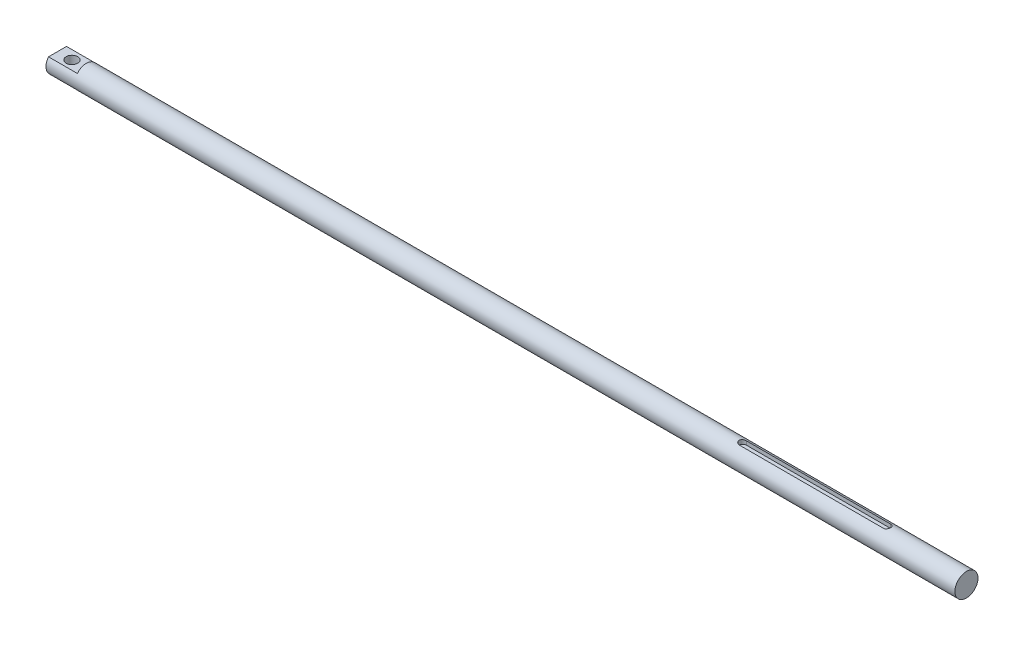
ISO-10303-21;
HEADER;
FILE_DESCRIPTION(('STEP AP214'),'2;1');
FILE_NAME('part.step','',(''),(''),'','','');
FILE_SCHEMA(('AUTOMOTIVE_DESIGN { 1 0 10303 214 1 1 1 1 }'));
ENDSEC;
DATA;
#1=APPLICATION_CONTEXT('core data for automotive mechanical design processes');
#2=APPLICATION_PROTOCOL_DEFINITION('international standard','automotive_design',2000,#1);
#3=PRODUCT_CONTEXT('',#1,'mechanical');
#4=PRODUCT('Part','Part','',(#3));
#5=PRODUCT_RELATED_PRODUCT_CATEGORY('part','',(#4));
#6=PRODUCT_DEFINITION_FORMATION('','',#4);
#7=PRODUCT_DEFINITION_CONTEXT('part definition',#1,'design');
#8=PRODUCT_DEFINITION('design','',#6,#7);
#9=PRODUCT_DEFINITION_SHAPE('','',#8);
#10=(LENGTH_UNIT() NAMED_UNIT(*) SI_UNIT(.MILLI.,.METRE.));
#11=(NAMED_UNIT(*) PLANE_ANGLE_UNIT() SI_UNIT($,.RADIAN.));
#12=(NAMED_UNIT(*) SI_UNIT($,.STERADIAN.) SOLID_ANGLE_UNIT());
#13=UNCERTAINTY_MEASURE_WITH_UNIT(LENGTH_MEASURE(1.E-05),#10,'distance_accuracy_value','');
#14=(GEOMETRIC_REPRESENTATION_CONTEXT(3) GLOBAL_UNCERTAINTY_ASSIGNED_CONTEXT((#13)) GLOBAL_UNIT_ASSIGNED_CONTEXT((#10,
#11,#12)) REPRESENTATION_CONTEXT('',''));
#15=CARTESIAN_POINT('',(0.,0.,0.));
#16=DIRECTION('',(0.,0.,1.));
#17=DIRECTION('',(1.,0.,0.));
#18=AXIS2_PLACEMENT_3D('',#15,#16,#17);
#19=CARTESIAN_POINT('',(630.,0.,0.));
#20=DIRECTION('',(-1.,0.,0.));
#21=DIRECTION('',(0.,0.,1.));
#22=AXIS2_PLACEMENT_3D('',#19,#20,#21);
#23=CYLINDRICAL_SURFACE('',#22,8.);
#24=CARTESIAN_POINT('',(630.,0.,0.));
#25=DIRECTION('',(1.,0.,0.));
#26=DIRECTION('',(0.,0.,-1.));
#27=AXIS2_PLACEMENT_3D('',#24,#25,#26);
#28=CIRCLE('',#27,8.);
#29=CARTESIAN_POINT('',(630.,0.,-8.));
#30=VERTEX_POINT('',#29);
#31=EDGE_CURVE('E158',#30,#30,#28,.T.);
#32=ORIENTED_EDGE('',*,*,#31,.F.);
#33=EDGE_LOOP('',(#32));
#34=FACE_BOUND('',#33,.T.);
#35=DIRECTION('',(-1.,0.,0.));
#36=VECTOR('',#35,1.);
#37=CARTESIAN_POINT('',(630.,5.,-6.2449979983984));
#38=LINE('',#37,#36);
#39=CARTESIAN_POINT('',(20.,5.,-6.2449979983984));
#40=VERTEX_POINT('',#39);
#41=CARTESIAN_POINT('',(0.,5.,-6.2449979983984));
#42=VERTEX_POINT('',#41);
#43=EDGE_CURVE('E155',#40,#42,#38,.T.);
#44=ORIENTED_EDGE('',*,*,#43,.F.);
#45=CARTESIAN_POINT('',(20.,0.,0.));
#46=DIRECTION('',(-1.,0.,0.));
#47=DIRECTION('',(0.,0.,1.));
#48=AXIS2_PLACEMENT_3D('',#45,#46,#47);
#49=CIRCLE('',#48,8.);
#50=CARTESIAN_POINT('',(20.,5.,6.2449979983984));
#51=VERTEX_POINT('',#50);
#52=EDGE_CURVE('E170',#51,#40,#49,.T.);
#53=ORIENTED_EDGE('',*,*,#52,.F.);
#54=DIRECTION('',(-1.,0.,0.));
#55=VECTOR('',#54,1.);
#56=CARTESIAN_POINT('',(630.,5.,6.2449979983984));
#57=LINE('',#56,#55);
#58=CARTESIAN_POINT('',(0.,5.,6.2449979983984));
#59=VERTEX_POINT('',#58);
#60=EDGE_CURVE('E153',#59,#51,#57,.F.);
#61=ORIENTED_EDGE('',*,*,#60,.F.);
#62=CARTESIAN_POINT('',(0.,0.,0.));
#63=DIRECTION('',(1.,0.,0.));
#64=DIRECTION('',(0.,0.,-1.));
#65=AXIS2_PLACEMENT_3D('',#62,#63,#64);
#66=CIRCLE('',#65,8.);
#67=CARTESIAN_POINT('',(0.,-5.,6.2449979983984));
#68=VERTEX_POINT('',#67);
#69=EDGE_CURVE('E162',#59,#68,#66,.T.);
#70=ORIENTED_EDGE('',*,*,#69,.T.);
#71=DIRECTION('',(-1.,0.,0.));
#72=VECTOR('',#71,1.);
#73=CARTESIAN_POINT('',(630.,-5.,6.2449979983984));
#74=LINE('',#73,#72);
#75=CARTESIAN_POINT('',(20.,-5.,6.2449979983984));
#76=VERTEX_POINT('',#75);
#77=EDGE_CURVE('E63',#76,#68,#74,.T.);
#78=ORIENTED_EDGE('',*,*,#77,.F.);
#79=CARTESIAN_POINT('',(20.,-5.,-6.2449979983984));
#80=VERTEX_POINT('',#79);
#81=EDGE_CURVE('E161',#80,#76,#49,.T.);
#82=ORIENTED_EDGE('',*,*,#81,.F.);
#83=DIRECTION('',(-1.,0.,0.));
#84=VECTOR('',#83,1.);
#85=CARTESIAN_POINT('',(630.,-5.,-6.2449979983984));
#86=LINE('',#85,#84);
#87=CARTESIAN_POINT('',(0.,-5.,-6.2449979983984));
#88=VERTEX_POINT('',#87);
#89=EDGE_CURVE('E149',#88,#80,#86,.F.);
#90=ORIENTED_EDGE('',*,*,#89,.F.);
#91=EDGE_CURVE('E157',#88,#42,#66,.T.);
#92=ORIENTED_EDGE('',*,*,#91,.T.);
#93=EDGE_LOOP('',(#44,#53,#61,#70,#78,#82,#90,#92));
#94=FACE_BOUND('',#93,.T.);
#95=CARTESIAN_POINT('',(475.000000000023,7.59934207678533,-2.5));
#96=CARTESIAN_POINT('',(474.931533959565,7.59933203220902,-2.50000871986673));
#97=CARTESIAN_POINT('',(474.863073619994,7.60026710840711,-2.49718761570795));
#98=CARTESIAN_POINT('',(474.726678509763,7.60395280971215,-2.48595363160388));
#99=CARTESIAN_POINT('',(474.658743616427,7.60670299725365,-2.47754209932906));
#100=CARTESIAN_POINT('',(474.524061009507,7.61393458112603,-2.45522504987252));
#101=CARTESIAN_POINT('',(474.457310599726,7.61841131277875,-2.4413343337542));
#102=CARTESIAN_POINT('',(474.325298022129,7.62895048428672,-2.4081974202195));
#103=CARTESIAN_POINT('',(474.260035898613,7.635012971277,-2.38895106361079));
#104=CARTESIAN_POINT('',(474.067212223615,7.65531370854487,-2.32342181812934));
#105=CARTESIAN_POINT('',(473.942431941948,7.67167572075378,-2.26931834784612));
#106=CARTESIAN_POINT('',(473.703712430238,7.70820192004961,-2.14195853376514));
#107=CARTESIAN_POINT('',(473.589778874535,7.72836808096501,-2.06869223944293));
#108=CARTESIAN_POINT('',(473.372050023845,7.77100200099821,-1.90239488451717));
#109=CARTESIAN_POINT('',(473.268677735629,7.79352168290041,-1.80882220631417));
#110=CARTESIAN_POINT('',(473.07880918272,7.83788426191508,-1.60572727958363));
#111=CARTESIAN_POINT('',(472.992315821626,7.85972704204082,-1.49620229250915));
#112=CARTESIAN_POINT('',(472.836776735929,7.900871470787,-1.26124953773951));
#113=CARTESIAN_POINT('',(472.768169952645,7.92010445950109,-1.13551807882696));
#114=CARTESIAN_POINT('',(472.653245915031,7.95325160259623,-0.873602960358824));
#115=CARTESIAN_POINT('',(472.606922529722,7.96716721976384,-0.737422187762075));
#116=CARTESIAN_POINT('',(472.539298114015,7.98774341182849,-0.46293009903665));
#117=CARTESIAN_POINT('',(472.517268955256,7.99461464054437,-0.324814247533371));
#118=CARTESIAN_POINT('',(472.496551274496,8.00107192504097,-0.0466844774853401));
#119=CARTESIAN_POINT('',(472.497857920094,8.00065948913008,0.0933290420878242));
#120=CARTESIAN_POINT('',(472.523296654594,7.99274230032624,0.366149731426198));
#121=CARTESIAN_POINT('',(472.546639028144,7.9854829352957,0.499038795957649));
#122=CARTESIAN_POINT('',(472.614190495554,7.96498949974601,0.758907586764614));
#123=CARTESIAN_POINT('',(472.65840071126,7.95175510801387,0.88588699493651));
#124=CARTESIAN_POINT('',(472.766940633049,7.92046911121014,1.13215685544432));
#125=CARTESIAN_POINT('',(472.831510175278,7.90236047968315,1.25133405943092));
#126=CARTESIAN_POINT('',(472.978743196462,7.86323423852227,1.47740616190408));
#127=CARTESIAN_POINT('',(473.061411060735,7.84221592431151,1.58429807401017));
#128=CARTESIAN_POINT('',(473.246538136379,7.79847545377197,1.78746586605745));
#129=CARTESIAN_POINT('',(473.349677407713,7.77571879038048,1.8831154358427));
#130=CARTESIAN_POINT('',(473.570770310085,7.73181622612536,2.05596538847766));
#131=CARTESIAN_POINT('',(473.688728388829,7.710670811935,2.1331602120539));
#132=CARTESIAN_POINT('',(473.937902943163,7.67220528705139,2.26764925996532));
#133=CARTESIAN_POINT('',(474.069258301443,7.65493278862761,2.32470027292371));
#134=CARTESIAN_POINT('',(474.340311873023,7.62673815128993,2.41560912229087));
#135=CARTESIAN_POINT('',(474.479996830664,7.615806204588,2.44950279382289));
#136=CARTESIAN_POINT('',(474.684175100982,7.6056422512493,2.48078343132755));
#137=CARTESIAN_POINT('',(474.747144936914,7.60328541577532,2.4879880725876));
#138=CARTESIAN_POINT('',(474.873398993315,7.6001348213116,2.49759244704614));
#139=CARTESIAN_POINT('',(474.936682642765,7.59933885501934,2.49999896558874));
#140=CARTESIAN_POINT('',(474.999999999966,7.59934207678533,2.5));
#141=B_SPLINE_CURVE_WITH_KNOTS('',3,(#95,#96,#97,#98,#99,#100,#101,#102,#103,#104,#105,#106,
#107,#108,#109,#110,#111,#112,#113,#114,#115,#116,#117,#118,#119,#120,#121,#122,#123,#124,#125,
#126,#127,#128,#129,#130,#131,#132,#133,#134,#135,#136,#137,#138,#139,#140),.UNSPECIFIED.,.F.,
.F.,(4,2,2,2,2,2,2,2,2,2,2,2,2,2,2,2,2,2,2,2,2,2,4),(0.,0.205323959878836,0.410598440770946,
0.615322164613197,0.82005197436187,1.22896577749132,1.63809233699115,2.05988351400763,
2.48174718582016,2.91315381297093,3.34444167638657,3.7624189439222,4.18030965733185,
4.58377069824248,4.98725343150216,5.39567896994507,5.80420358180014,6.2297165423659,
6.65535752260475,7.08597472101229,7.51592403685244,7.70602799871622,7.8958629307134),.UNSPECIFIED.);
#142=CARTESIAN_POINT('',(475.000000000023,7.59934207678533,-2.5));
#143=VERTEX_POINT('',#142);
#144=CARTESIAN_POINT('',(474.999999999966,7.59934207678533,2.5));
#145=VERTEX_POINT('',#144);
#146=EDGE_CURVE('E171',#143,#145,#141,.T.);
#147=ORIENTED_EDGE('',*,*,#146,.F.);
#148=DIRECTION('',(-1.,0.,0.));
#149=VECTOR('',#148,1.);
#150=CARTESIAN_POINT('',(630.,7.59934207678079,-2.5000000000138));
#151=LINE('',#150,#149);
#152=CARTESIAN_POINT('',(575.000000000045,7.59934207678079,-2.50000000001379));
#153=VERTEX_POINT('',#152);
#154=EDGE_CURVE('E12',#143,#153,#151,.F.);
#155=ORIENTED_EDGE('',*,*,#154,.T.);
#156=CARTESIAN_POINT('',(575.000000000045,7.59934207678534,2.49999999999998));
#157=CARTESIAN_POINT('',(575.068466040503,7.59933203220964,2.50000871986485));
#158=CARTESIAN_POINT('',(575.136926380074,7.60026710840835,2.49718761570418));
#159=CARTESIAN_POINT('',(575.273321490305,7.60395280971462,2.48595363159632));
#160=CARTESIAN_POINT('',(575.341256383642,7.60670299725674,2.4775420993196));
#161=CARTESIAN_POINT('',(575.475938990561,7.61393458113031,2.45522504985927));
#162=CARTESIAN_POINT('',(575.542689400342,7.61841131278361,2.44133433373907));
#163=CARTESIAN_POINT('',(575.674701977938,7.62895048429269,2.4081974202006));
#164=CARTESIAN_POINT('',(575.739964101454,7.63501297128352,2.38895106358999));
#165=CARTESIAN_POINT('',(575.932787776451,7.6553137085529,2.32342181810293));
#166=CARTESIAN_POINT('',(576.057568058117,7.6716757207627,2.26931834781609));
#167=CARTESIAN_POINT('',(576.296287569823,7.70820192005996,2.141958533728));
#168=CARTESIAN_POINT('',(576.410221125524,7.72836808097592,2.0686922394023));
#169=CARTESIAN_POINT('',(576.62794997621,7.77100200100986,1.90239488446972));
#170=CARTESIAN_POINT('',(576.731322264424,7.79352168291224,1.80882220626337));
#171=CARTESIAN_POINT('',(576.921190817328,7.83788426192685,1.60572727952637));
#172=CARTESIAN_POINT('',(577.007684178419,7.85972704205235,1.49620229244878));
#173=CARTESIAN_POINT('',(577.16322326411,7.90087147079751,1.26124953767388));
#174=CARTESIAN_POINT('',(577.23183004739,7.92010445951082,1.13551807875924));
#175=CARTESIAN_POINT('',(577.346754084996,7.95325160260409,0.873602960287575));
#176=CARTESIAN_POINT('',(577.3930774703,7.96716721977058,0.737422187689386));
#177=CARTESIAN_POINT('',(577.460701885999,7.9877434118328,0.462930098962372));
#178=CARTESIAN_POINT('',(577.482731044753,7.99461464054739,0.324814247458944));
#179=CARTESIAN_POINT('',(577.503448725505,8.0010719250414,0.0466844774113888));
#180=CARTESIAN_POINT('',(577.502142079903,8.00065948912921,-0.0933290421611512));
#181=CARTESIAN_POINT('',(577.476703345395,7.99274230032294,-0.366149731497964));
#182=CARTESIAN_POINT('',(577.453360971842,7.98548293529125,-0.499038796028497));
#183=CARTESIAN_POINT('',(577.385809504424,7.96498949973948,-0.758907586833018));
#184=CARTESIAN_POINT('',(577.341599288714,7.9517551080064,-0.885886995003387));
#185=CARTESIAN_POINT('',(577.233059366919,7.920469111201,-1.13215685550818));
#186=CARTESIAN_POINT('',(577.168489824686,7.90236047967326,-1.25133405949323));
#187=CARTESIAN_POINT('',(577.021256803495,7.86323423851123,-1.47740616196273));
#188=CARTESIAN_POINT('',(576.938588939218,7.84221592430006,-1.5842980740667));
#189=CARTESIAN_POINT('',(576.753461863569,7.79847545376009,-1.78746586610914));
#190=CARTESIAN_POINT('',(576.650322592231,7.77571879036859,-1.88311543589166));
#191=CARTESIAN_POINT('',(576.429229689854,7.7318162261139,-2.05596538852062));
#192=CARTESIAN_POINT('',(576.311271611107,7.71067081192399,-2.13316021209358));
#193=CARTESIAN_POINT('',(576.062097056768,7.67220528704181,-2.26764925999761));
#194=CARTESIAN_POINT('',(575.930741698487,7.65493278861901,-2.32470027295196));
#195=CARTESIAN_POINT('',(575.659688126904,7.62673815128358,-2.41560912231083));
#196=CARTESIAN_POINT('',(575.520003169262,7.61580620458293,-2.44950279383862));
#197=CARTESIAN_POINT('',(575.315824898958,7.60564225124689,-2.48078343133491));
#198=CARTESIAN_POINT('',(575.25285506304,7.60328541577389,-2.48798807259196));
#199=CARTESIAN_POINT('',(575.126601006668,7.60013482131143,-2.49759244704668));
#200=CARTESIAN_POINT('',(575.063317357232,7.59933885501944,-2.49999896558846));
#201=CARTESIAN_POINT('',(575.000000000045,7.59934207678533,-2.50000000000002));
#202=B_SPLINE_CURVE_WITH_KNOTS('',3,(#156,#157,#158,#159,#160,#161,#162,#163,#164,#165,#166,
#167,#168,#169,#170,#171,#172,#173,#174,#175,#176,#177,#178,#179,#180,#181,#182,#183,#184,#185,
#186,#187,#188,#189,#190,#191,#192,#193,#194,#195,#196,#197,#198,#199,#200,#201),.UNSPECIFIED.,
.F.,.F.,(4,2,2,2,2,2,2,2,2,2,2,2,2,2,2,2,2,2,2,2,2,2,4),(0.,0.205323959879425,0.410598440772143,
0.615322164615003,0.820051974364466,1.22896577749508,1.63809233699612,2.05988351401434,
2.48174718582851,2.91315381297902,3.34444167639445,3.76241894392834,4.18030965733627,
4.58377069824635,4.98725343150552,5.39567896994971,5.80420358180613,6.2297165423731,
6.65535752261331,7.08597472102025,7.51592403685968,7.7060279986801,7.89586293063386),.UNSPECIFIED.);
#203=CARTESIAN_POINT('',(575.000000000045,7.59934207679137,2.49999999998166));
#204=VERTEX_POINT('',#203);
#205=EDGE_CURVE('E113',#204,#153,#202,.T.);
#206=ORIENTED_EDGE('',*,*,#205,.F.);
#207=DIRECTION('',(-1.,0.,0.));
#208=VECTOR('',#207,1.);
#209=CARTESIAN_POINT('',(630.,7.59934207679137,2.49999999998165));
#210=LINE('',#209,#208);
#211=EDGE_CURVE('E48',#204,#145,#210,.T.);
#212=ORIENTED_EDGE('',*,*,#211,.T.);
#213=EDGE_LOOP('',(#147,#155,#206,#212));
#214=FACE_BOUND('',#213,.T.);
#215=ADVANCED_FACE('F40',(#34,#94,#214),#23,.T.);
#216=CARTESIAN_POINT('',(0.,0.,0.));
#217=DIRECTION('',(1.,0.,0.));
#218=DIRECTION('',(0.,0.,-1.));
#219=AXIS2_PLACEMENT_3D('',#216,#217,#218);
#220=PLANE('',#219);
#221=DIRECTION('',(0.,0.,-1.));
#222=VECTOR('',#221,1.);
#223=CARTESIAN_POINT('',(0.,5.,-10.));
#224=LINE('',#223,#222);
#225=EDGE_CURVE('E142',#59,#42,#224,.T.);
#226=ORIENTED_EDGE('',*,*,#225,.T.);
#227=ORIENTED_EDGE('',*,*,#91,.F.);
#228=DIRECTION('',(0.,0.,1.));
#229=VECTOR('',#228,1.);
#230=CARTESIAN_POINT('',(0.,-5.,-10.));
#231=LINE('',#230,#229);
#232=EDGE_CURVE('E117',#88,#68,#231,.T.);
#233=ORIENTED_EDGE('',*,*,#232,.T.);
#234=ORIENTED_EDGE('',*,*,#69,.F.);
#235=EDGE_LOOP('',(#226,#227,#233,#234));
#236=FACE_BOUND('',#235,.T.);
#237=ADVANCED_FACE('F212',(#236),#220,.F.);
#238=CARTESIAN_POINT('',(630.,0.,0.));
#239=DIRECTION('',(1.,0.,0.));
#240=DIRECTION('',(0.,0.,-1.));
#241=AXIS2_PLACEMENT_3D('',#238,#239,#240);
#242=PLANE('',#241);
#243=ORIENTED_EDGE('',*,*,#31,.T.);
#244=EDGE_LOOP('',(#243));
#245=FACE_BOUND('',#244,.T.);
#246=ADVANCED_FACE('F203',(#245),#242,.T.);
#247=CARTESIAN_POINT('',(20.,-5.,-10.));
#248=DIRECTION('',(0.,-1.,0.));
#249=DIRECTION('',(0.,0.,-1.));
#250=AXIS2_PLACEMENT_3D('',#247,#248,#249);
#251=PLANE('',#250);
#252=CARTESIAN_POINT('',(10.,-5.,0.));
#253=DIRECTION('',(0.,-1.,0.));
#254=DIRECTION('',(0.,0.,-1.));
#255=AXIS2_PLACEMENT_3D('',#252,#253,#254);
#256=CIRCLE('',#255,4.);
#257=CARTESIAN_POINT('',(10.,-5.,-4.));
#258=VERTEX_POINT('',#257);
#259=EDGE_CURVE('E145',#258,#258,#256,.F.);
#260=ORIENTED_EDGE('',*,*,#259,.T.);
#261=EDGE_LOOP('',(#260));
#262=FACE_BOUND('',#261,.T.);
#263=ORIENTED_EDGE('',*,*,#77,.T.);
#264=ORIENTED_EDGE('',*,*,#232,.F.);
#265=ORIENTED_EDGE('',*,*,#89,.T.);
#266=DIRECTION('',(0.,0.,1.));
#267=VECTOR('',#266,1.);
#268=CARTESIAN_POINT('',(20.,-5.,-10.));
#269=LINE('',#268,#267);
#270=EDGE_CURVE('E139',#80,#76,#269,.T.);
#271=ORIENTED_EDGE('',*,*,#270,.T.);
#272=EDGE_LOOP('',(#263,#264,#265,#271));
#273=FACE_BOUND('',#272,.T.);
#274=ADVANCED_FACE('F199',(#262,#273),#251,.T.);
#275=CARTESIAN_POINT('',(20.,0.,0.));
#276=DIRECTION('',(-1.,0.,0.));
#277=DIRECTION('',(0.,0.,1.));
#278=AXIS2_PLACEMENT_3D('',#275,#276,#277);
#279=PLANE('',#278);
#280=ORIENTED_EDGE('',*,*,#81,.T.);
#281=ORIENTED_EDGE('',*,*,#270,.F.);
#282=EDGE_LOOP('',(#280,#281));
#283=FACE_BOUND('',#282,.T.);
#284=ADVANCED_FACE('F202',(#283),#279,.T.);
#285=ORIENTED_EDGE('',*,*,#52,.T.);
#286=DIRECTION('',(0.,0.,-1.));
#287=VECTOR('',#286,1.);
#288=CARTESIAN_POINT('',(20.,5.,-10.));
#289=LINE('',#288,#287);
#290=EDGE_CURVE('E141',#51,#40,#289,.T.);
#291=ORIENTED_EDGE('',*,*,#290,.F.);
#292=EDGE_LOOP('',(#285,#291));
#293=FACE_BOUND('',#292,.T.);
#294=ADVANCED_FACE('F197',(#293),#279,.T.);
#295=CARTESIAN_POINT('',(20.,5.,-10.));
#296=DIRECTION('',(0.,1.,0.));
#297=DIRECTION('',(0.,0.,1.));
#298=AXIS2_PLACEMENT_3D('',#295,#296,#297);
#299=PLANE('',#298);
#300=CARTESIAN_POINT('',(10.,5.,0.));
#301=DIRECTION('',(0.,1.,0.));
#302=DIRECTION('',(0.,0.,1.));
#303=AXIS2_PLACEMENT_3D('',#300,#301,#302);
#304=CIRCLE('',#303,4.);
#305=CARTESIAN_POINT('',(10.,5.,4.));
#306=VERTEX_POINT('',#305);
#307=EDGE_CURVE('E152',#306,#306,#304,.F.);
#308=ORIENTED_EDGE('',*,*,#307,.T.);
#309=EDGE_LOOP('',(#308));
#310=FACE_BOUND('',#309,.T.);
#311=ORIENTED_EDGE('',*,*,#43,.T.);
#312=ORIENTED_EDGE('',*,*,#225,.F.);
#313=ORIENTED_EDGE('',*,*,#60,.T.);
#314=ORIENTED_EDGE('',*,*,#290,.T.);
#315=EDGE_LOOP('',(#311,#312,#313,#314));
#316=FACE_BOUND('',#315,.T.);
#317=ADVANCED_FACE('F194',(#310,#316),#299,.T.);
#318=CARTESIAN_POINT('',(10.,-8.,0.));
#319=DIRECTION('',(0.,1.,0.));
#320=DIRECTION('',(0.,0.,1.));
#321=AXIS2_PLACEMENT_3D('',#318,#319,#320);
#322=CYLINDRICAL_SURFACE('',#321,4.);
#323=ORIENTED_EDGE('',*,*,#259,.F.);
#324=EDGE_LOOP('',(#323));
#325=FACE_BOUND('',#324,.T.);
#326=ORIENTED_EDGE('',*,*,#307,.F.);
#327=EDGE_LOOP('',(#326));
#328=FACE_BOUND('',#327,.T.);
#329=ADVANCED_FACE('F193',(#325,#328),#322,.F.);
#330=CARTESIAN_POINT('',(575.,8.,0.));
#331=DIRECTION('',(0.,-1.,0.));
#332=DIRECTION('',(0.,0.,-1.));
#333=AXIS2_PLACEMENT_3D('',#330,#331,#332);
#334=CYLINDRICAL_SURFACE('',#333,2.5);
#335=DIRECTION('',(0.,-1.,0.));
#336=VECTOR('',#335,1.);
#337=CARTESIAN_POINT('',(575.000000000045,8.,2.49999999998166));
#338=LINE('',#337,#336);
#339=CARTESIAN_POINT('',(575.000000000045,5.,2.49999999998166));
#340=VERTEX_POINT('',#339);
#341=EDGE_CURVE('E135',#204,#340,#338,.T.);
#342=ORIENTED_EDGE('',*,*,#341,.F.);
#343=ORIENTED_EDGE('',*,*,#205,.T.);
#344=DIRECTION('',(0.,-1.,0.));
#345=VECTOR('',#344,1.);
#346=CARTESIAN_POINT('',(575.000000000045,8.,-2.50000000001379));
#347=LINE('',#346,#345);
#348=CARTESIAN_POINT('',(575.000000000045,5.,-2.50000000001379));
#349=VERTEX_POINT('',#348);
#350=EDGE_CURVE('E107',#153,#349,#347,.T.);
#351=ORIENTED_EDGE('',*,*,#350,.T.);
#352=CARTESIAN_POINT('',(575.,5.,0.));
#353=DIRECTION('',(0.,1.,0.));
#354=DIRECTION('',(0.,0.,1.));
#355=AXIS2_PLACEMENT_3D('',#352,#353,#354);
#356=CIRCLE('',#355,2.5);
#357=EDGE_CURVE('E111',#340,#349,#356,.T.);
#358=ORIENTED_EDGE('',*,*,#357,.F.);
#359=EDGE_LOOP('',(#342,#343,#351,#358));
#360=FACE_BOUND('',#359,.T.);
#361=ADVANCED_FACE('F110',(#360),#334,.F.);
#362=CARTESIAN_POINT('',(-399700.066938516,8.,-2.49999999994088));
#363=DIRECTION('',(0.,0.,-1.));
#364=DIRECTION('',(-1.,0.,0.));
#365=AXIS2_PLACEMENT_3D('',#362,#363,#364);
#366=PLANE('',#365);
#367=DIRECTION('',(0.,-1.,0.));
#368=VECTOR('',#367,1.);
#369=CARTESIAN_POINT('',(475.000000000023,8.,-2.5));
#370=LINE('',#369,#368);
#371=CARTESIAN_POINT('',(475.000000000023,5.,-2.5));
#372=VERTEX_POINT('',#371);
#373=EDGE_CURVE('E118',#143,#372,#370,.T.);
#374=ORIENTED_EDGE('',*,*,#373,.T.);
#375=DIRECTION('',(1.,0.,0.));
#376=VECTOR('',#375,1.);
#377=CARTESIAN_POINT('',(-399700.066938516,5.,-2.49999999994088));
#378=LINE('',#377,#376);
#379=EDGE_CURVE('E124',#372,#349,#378,.T.);
#380=ORIENTED_EDGE('',*,*,#379,.T.);
#381=ORIENTED_EDGE('',*,*,#350,.F.);
#382=ORIENTED_EDGE('',*,*,#154,.F.);
#383=EDGE_LOOP('',(#374,#380,#381,#382));
#384=FACE_BOUND('',#383,.T.);
#385=ADVANCED_FACE('F127',(#384),#366,.F.);
#386=CARTESIAN_POINT('',(475.,8.,0.));
#387=DIRECTION('',(0.,-1.,0.));
#388=DIRECTION('',(0.,0.,-1.));
#389=AXIS2_PLACEMENT_3D('',#386,#387,#388);
#390=CYLINDRICAL_SURFACE('',#389,2.5);
#391=ORIENTED_EDGE('',*,*,#373,.F.);
#392=ORIENTED_EDGE('',*,*,#146,.T.);
#393=DIRECTION('',(0.,-1.,0.));
#394=VECTOR('',#393,1.);
#395=CARTESIAN_POINT('',(474.999999999966,8.,2.49999999998168));
#396=LINE('',#395,#394);
#397=CARTESIAN_POINT('',(474.999999999966,5.,2.49999999998168));
#398=VERTEX_POINT('',#397);
#399=EDGE_CURVE('E55',#145,#398,#396,.T.);
#400=ORIENTED_EDGE('',*,*,#399,.T.);
#401=CARTESIAN_POINT('',(475.,5.,0.));
#402=DIRECTION('',(0.,1.,0.));
#403=DIRECTION('',(0.,0.,1.));
#404=AXIS2_PLACEMENT_3D('',#401,#402,#403);
#405=CIRCLE('',#404,2.5);
#406=EDGE_CURVE('E130',#372,#398,#405,.T.);
#407=ORIENTED_EDGE('',*,*,#406,.F.);
#408=EDGE_LOOP('',(#391,#392,#400,#407));
#409=FACE_BOUND('',#408,.T.);
#410=ADVANCED_FACE('F181',(#409),#390,.F.);
#411=CARTESIAN_POINT('',(-399700.066938516,8.,2.50000000005457));
#412=DIRECTION('',(0.,0.,1.));
#413=DIRECTION('',(1.,0.,0.));
#414=AXIS2_PLACEMENT_3D('',#411,#412,#413);
#415=PLANE('',#414);
#416=ORIENTED_EDGE('',*,*,#341,.T.);
#417=DIRECTION('',(-1.,0.,0.));
#418=VECTOR('',#417,1.);
#419=CARTESIAN_POINT('',(-399700.066938516,5.,2.50000000005457));
#420=LINE('',#419,#418);
#421=EDGE_CURVE('E125',#340,#398,#420,.T.);
#422=ORIENTED_EDGE('',*,*,#421,.T.);
#423=ORIENTED_EDGE('',*,*,#399,.F.);
#424=ORIENTED_EDGE('',*,*,#211,.F.);
#425=EDGE_LOOP('',(#416,#422,#423,#424));
#426=FACE_BOUND('',#425,.T.);
#427=ADVANCED_FACE('F186',(#426),#415,.F.);
#428=CARTESIAN_POINT('',(575.,5.,0.));
#429=DIRECTION('',(0.,1.,0.));
#430=DIRECTION('',(0.,0.,1.));
#431=AXIS2_PLACEMENT_3D('',#428,#429,#430);
#432=PLANE('',#431);
#433=ORIENTED_EDGE('',*,*,#357,.T.);
#434=ORIENTED_EDGE('',*,*,#379,.F.);
#435=ORIENTED_EDGE('',*,*,#406,.T.);
#436=ORIENTED_EDGE('',*,*,#421,.F.);
#437=EDGE_LOOP('',(#433,#434,#435,#436));
#438=FACE_BOUND('',#437,.T.);
#439=ADVANCED_FACE('F122',(#438),#432,.T.);
#440=CLOSED_SHELL('',(#215,#237,#246,#274,#284,#294,#317,#329,#361,#385,#410,#427,#439));
#441=MANIFOLD_SOLID_BREP('B2',#440);
#442=ADVANCED_BREP_SHAPE_REPRESENTATION('',(#18,#441),#14);
#443=SHAPE_DEFINITION_REPRESENTATION(#9,#442);
ENDSEC;
END-ISO-10303-21;
